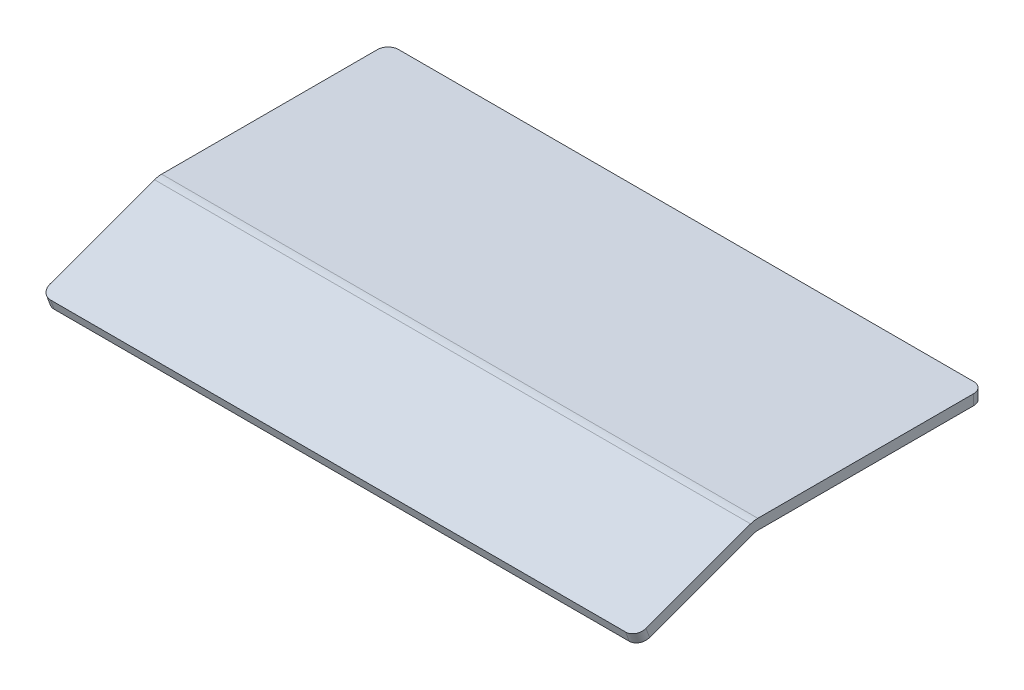
ISO-10303-21;
HEADER;
FILE_DESCRIPTION(('STEP AP214'),'2;1');
FILE_NAME('part.step','',(''),(''),'','','');
FILE_SCHEMA(('AUTOMOTIVE_DESIGN { 1 0 10303 214 1 1 1 1 }'));
ENDSEC;
DATA;
#1=APPLICATION_CONTEXT('core data for automotive mechanical design processes');
#2=APPLICATION_PROTOCOL_DEFINITION('international standard','automotive_design',2000,#1);
#3=PRODUCT_CONTEXT('',#1,'mechanical');
#4=PRODUCT('Part','Part','',(#3));
#5=PRODUCT_RELATED_PRODUCT_CATEGORY('part','',(#4));
#6=PRODUCT_DEFINITION_FORMATION('','',#4);
#7=PRODUCT_DEFINITION_CONTEXT('part definition',#1,'design');
#8=PRODUCT_DEFINITION('design','',#6,#7);
#9=PRODUCT_DEFINITION_SHAPE('','',#8);
#10=(LENGTH_UNIT() NAMED_UNIT(*) SI_UNIT(.MILLI.,.METRE.));
#11=(NAMED_UNIT(*) PLANE_ANGLE_UNIT() SI_UNIT($,.RADIAN.));
#12=(NAMED_UNIT(*) SI_UNIT($,.STERADIAN.) SOLID_ANGLE_UNIT());
#13=UNCERTAINTY_MEASURE_WITH_UNIT(LENGTH_MEASURE(1.E-05),#10,'distance_accuracy_value','');
#14=(GEOMETRIC_REPRESENTATION_CONTEXT(3) GLOBAL_UNCERTAINTY_ASSIGNED_CONTEXT((#13)) GLOBAL_UNIT_ASSIGNED_CONTEXT((#10,
#11,#12)) REPRESENTATION_CONTEXT('',''));
#15=CARTESIAN_POINT('',(0.,0.,0.));
#16=DIRECTION('',(0.,0.,1.));
#17=DIRECTION('',(1.,0.,0.));
#18=AXIS2_PLACEMENT_3D('',#15,#16,#17);
#19=CARTESIAN_POINT('',(180.975,6.35,0.));
#20=DIRECTION('',(0.,1.,0.));
#21=DIRECTION('',(0.,0.,1.));
#22=AXIS2_PLACEMENT_3D('',#19,#20,#21);
#23=PLANE('',#22);
#24=DIRECTION('',(0.,0.,-1.));
#25=VECTOR('',#24,1.);
#26=CARTESIAN_POINT('',(180.975,6.35,0.));
#27=LINE('',#26,#25);
#28=CARTESIAN_POINT('',(180.975,6.35,-1.11967632749875));
#29=VERTEX_POINT('',#28);
#30=CARTESIAN_POINT('',(180.975,6.35,-132.230323672501));
#31=VERTEX_POINT('',#30);
#32=EDGE_CURVE('E135',#29,#31,#27,.T.);
#33=ORIENTED_EDGE('',*,*,#32,.T.);
#34=CARTESIAN_POINT('',(174.625,6.35,-132.230323672501));
#35=DIRECTION('',(0.,1.,0.));
#36=DIRECTION('',(0.,0.,1.));
#37=AXIS2_PLACEMENT_3D('',#34,#35,#36);
#38=CIRCLE('',#37,6.35);
#39=CARTESIAN_POINT('',(174.625,6.35,-138.580323672501));
#40=VERTEX_POINT('',#39);
#41=EDGE_CURVE('E224',#31,#40,#38,.T.);
#42=ORIENTED_EDGE('',*,*,#41,.T.);
#43=DIRECTION('',(-1.,0.,0.));
#44=VECTOR('',#43,1.);
#45=CARTESIAN_POINT('',(180.975,6.35,-138.580323672501));
#46=LINE('',#45,#44);
#47=CARTESIAN_POINT('',(-174.625,6.35,-138.580323672501));
#48=VERTEX_POINT('',#47);
#49=EDGE_CURVE('E178',#40,#48,#46,.T.);
#50=ORIENTED_EDGE('',*,*,#49,.T.);
#51=CARTESIAN_POINT('',(-174.625,6.35,-132.230323672501));
#52=DIRECTION('',(0.,1.,0.));
#53=DIRECTION('',(0.,0.,1.));
#54=AXIS2_PLACEMENT_3D('',#51,#52,#53);
#55=CIRCLE('',#54,6.35);
#56=CARTESIAN_POINT('',(-180.975,6.35,-132.230323672501));
#57=VERTEX_POINT('',#56);
#58=EDGE_CURVE('E221',#48,#57,#55,.T.);
#59=ORIENTED_EDGE('',*,*,#58,.T.);
#60=DIRECTION('',(0.,0.,-1.));
#61=VECTOR('',#60,1.);
#62=CARTESIAN_POINT('',(-180.975,6.35,0.));
#63=LINE('',#62,#61);
#64=CARTESIAN_POINT('',(-180.975,6.35,-1.11967632749875));
#65=VERTEX_POINT('',#64);
#66=EDGE_CURVE('E137',#65,#57,#63,.T.);
#67=ORIENTED_EDGE('',*,*,#66,.F.);
#68=DIRECTION('',(-1.,0.,0.));
#69=VECTOR('',#68,1.);
#70=CARTESIAN_POINT('',(180.975,6.35,-1.11967632749875));
#71=LINE('',#70,#69);
#72=EDGE_CURVE('E132',#29,#65,#71,.T.);
#73=ORIENTED_EDGE('',*,*,#72,.F.);
#74=EDGE_LOOP('',(#33,#42,#50,#59,#67,#73));
#75=FACE_BOUND('',#74,.T.);
#76=ADVANCED_FACE('F42',(#75),#23,.T.);
#77=CARTESIAN_POINT('',(180.975,-6.35,-1.11967632749875));
#78=DIRECTION('',(-1.,0.,0.));
#79=DIRECTION('',(0.,0.,1.));
#80=AXIS2_PLACEMENT_3D('',#77,#78,#79);
#81=CYLINDRICAL_SURFACE('',#80,12.7);
#82=CARTESIAN_POINT('',(-180.975,-6.35,-1.11967632749875));
#83=DIRECTION('',(1.,0.,0.));
#84=DIRECTION('',(0.,0.,-1.));
#85=AXIS2_PLACEMENT_3D('',#82,#83,#84);
#86=CIRCLE('',#85,12.7);
#87=CARTESIAN_POINT('',(-180.975,5.58409628398103,3.22397949273726));
#88=VERTEX_POINT('',#87);
#89=EDGE_CURVE('E181',#65,#88,#86,.T.);
#90=ORIENTED_EDGE('',*,*,#89,.T.);
#91=DIRECTION('',(-1.,0.,0.));
#92=VECTOR('',#91,1.);
#93=CARTESIAN_POINT('',(180.975,5.58409628398103,3.22397949273726));
#94=LINE('',#93,#92);
#95=CARTESIAN_POINT('',(180.975,5.58409628398103,3.22397949273726));
#96=VERTEX_POINT('',#95);
#97=EDGE_CURVE('E142',#96,#88,#94,.T.);
#98=ORIENTED_EDGE('',*,*,#97,.F.);
#99=CARTESIAN_POINT('',(180.975,-6.35,-1.11967632749875));
#100=DIRECTION('',(1.,0.,0.));
#101=DIRECTION('',(0.,0.,-1.));
#102=AXIS2_PLACEMENT_3D('',#99,#100,#101);
#103=CIRCLE('',#102,12.7);
#104=EDGE_CURVE('E145',#29,#96,#103,.T.);
#105=ORIENTED_EDGE('',*,*,#104,.F.);
#106=ORIENTED_EDGE('',*,*,#72,.T.);
#107=EDGE_LOOP('',(#90,#98,#105,#106));
#108=FACE_BOUND('',#107,.T.);
#109=ADVANCED_FACE('F146',(#108),#81,.T.);
#110=CARTESIAN_POINT('',(180.975,5.96704814199051,2.171827910118));
#111=DIRECTION('',(0.,-0.939692620785908,-0.34202014332567));
#112=DIRECTION('',(0.,0.34202014332567,-0.939692620785908));
#113=AXIS2_PLACEMENT_3D('',#110,#111,#112);
#114=PLANE('',#113);
#115=DIRECTION('',(0.,-0.34202014332567,0.939692620785908));
#116=VECTOR('',#115,1.);
#117=CARTESIAN_POINT('',(-180.975,5.96704814199051,2.171827910118));
#118=LINE('',#117,#116);
#119=CARTESIAN_POINT('',(-180.975,-17.540107011298,66.7572058893944));
#120=VERTEX_POINT('',#119);
#121=EDGE_CURVE('E184',#88,#120,#118,.T.);
#122=ORIENTED_EDGE('',*,*,#121,.T.);
#123=CARTESIAN_POINT('',(-174.625,-17.5401070112981,66.7572058893944));
#124=DIRECTION('',(0.,-0.939692620785908,-0.34202014332567));
#125=DIRECTION('',(0.,0.34202014332567,-0.939692620785908));
#126=AXIS2_PLACEMENT_3D('',#123,#124,#125);
#127=CIRCLE('',#126,6.35);
#128=CARTESIAN_POINT('',(-174.625,-19.7119349214161,72.7242540313849));
#129=VERTEX_POINT('',#128);
#130=EDGE_CURVE('E11',#120,#129,#127,.F.);
#131=ORIENTED_EDGE('',*,*,#130,.T.);
#132=DIRECTION('',(-1.,0.,0.));
#133=VECTOR('',#132,1.);
#134=CARTESIAN_POINT('',(180.975,-19.7119349214161,72.7242540313849));
#135=LINE('',#134,#133);
#136=CARTESIAN_POINT('',(174.625,-19.7119349214161,72.7242540313849));
#137=VERTEX_POINT('',#136);
#138=EDGE_CURVE('E211',#137,#129,#135,.T.);
#139=ORIENTED_EDGE('',*,*,#138,.F.);
#140=CARTESIAN_POINT('',(174.625,-17.540107011298,66.7572058893944));
#141=DIRECTION('',(0.,-0.939692620785908,-0.34202014332567));
#142=DIRECTION('',(0.,0.34202014332567,-0.939692620785908));
#143=AXIS2_PLACEMENT_3D('',#140,#141,#142);
#144=CIRCLE('',#143,6.35);
#145=CARTESIAN_POINT('',(180.975,-17.540107011298,66.7572058893944));
#146=VERTEX_POINT('',#145);
#147=EDGE_CURVE('E51',#137,#146,#144,.F.);
#148=ORIENTED_EDGE('',*,*,#147,.T.);
#149=DIRECTION('',(0.,-0.34202014332567,0.939692620785908));
#150=VECTOR('',#149,1.);
#151=CARTESIAN_POINT('',(180.975,5.96704814199051,2.171827910118));
#152=LINE('',#151,#150);
#153=EDGE_CURVE('E152',#96,#146,#152,.T.);
#154=ORIENTED_EDGE('',*,*,#153,.F.);
#155=ORIENTED_EDGE('',*,*,#97,.T.);
#156=EDGE_LOOP('',(#122,#131,#139,#148,#154,#155));
#157=FACE_BOUND('',#156,.T.);
#158=ADVANCED_FACE('F259',(#157),#114,.F.);
#159=CARTESIAN_POINT('',(180.975,-25.6789830634065,70.5524261212669));
#160=DIRECTION('',(0.,0.342020143325669,-0.939692620785908));
#161=DIRECTION('',(0.,0.939692620785908,0.342020143325669));
#162=AXIS2_PLACEMENT_3D('',#159,#160,#161);
#163=PLANE('',#162);
#164=ORIENTED_EDGE('',*,*,#138,.T.);
#165=DIRECTION('',(0.,-0.939692620785908,-0.342020143325669));
#166=VECTOR('',#165,1.);
#167=CARTESIAN_POINT('',(-174.625,-25.6789830634065,70.5524261212669));
#168=LINE('',#167,#166);
#169=CARTESIAN_POINT('',(-174.625,-25.6789830634066,70.5524261212669));
#170=VERTEX_POINT('',#169);
#171=EDGE_CURVE('E248',#129,#170,#168,.T.);
#172=ORIENTED_EDGE('',*,*,#171,.T.);
#173=DIRECTION('',(-1.,0.,0.));
#174=VECTOR('',#173,1.);
#175=CARTESIAN_POINT('',(180.975,-25.6789830634066,70.5524261212669));
#176=LINE('',#175,#174);
#177=CARTESIAN_POINT('',(174.625,-25.6789830634066,70.5524261212669));
#178=VERTEX_POINT('',#177);
#179=EDGE_CURVE('E207',#178,#170,#176,.T.);
#180=ORIENTED_EDGE('',*,*,#179,.F.);
#181=DIRECTION('',(0.,-0.939692620785908,-0.342020143325669));
#182=VECTOR('',#181,1.);
#183=CARTESIAN_POINT('',(174.625,-19.7119349214161,72.7242540313849));
#184=LINE('',#183,#182);
#185=EDGE_CURVE('E63',#178,#137,#184,.F.);
#186=ORIENTED_EDGE('',*,*,#185,.T.);
#187=EDGE_LOOP('',(#164,#172,#180,#186));
#188=FACE_BOUND('',#187,.T.);
#189=ADVANCED_FACE('F266',(#188),#163,.F.);
#190=CARTESIAN_POINT('',(180.975,0.,0.));
#191=DIRECTION('',(0.,0.939692620785908,0.34202014332567));
#192=DIRECTION('',(0.,-0.34202014332567,0.939692620785908));
#193=AXIS2_PLACEMENT_3D('',#190,#191,#192);
#194=PLANE('',#193);
#195=ORIENTED_EDGE('',*,*,#179,.T.);
#196=CARTESIAN_POINT('',(-174.625,-23.5071551532886,64.5853779792764));
#197=DIRECTION('',(0.,0.939692620785908,0.34202014332567));
#198=DIRECTION('',(0.,-0.34202014332567,0.939692620785908));
#199=AXIS2_PLACEMENT_3D('',#196,#197,#198);
#200=CIRCLE('',#199,6.35);
#201=CARTESIAN_POINT('',(-180.975,-23.5071551532886,64.5853779792764));
#202=VERTEX_POINT('',#201);
#203=EDGE_CURVE('E255',#170,#202,#200,.F.);
#204=ORIENTED_EDGE('',*,*,#203,.T.);
#205=DIRECTION('',(0.,0.34202014332567,-0.939692620785908));
#206=VECTOR('',#205,1.);
#207=CARTESIAN_POINT('',(-180.975,0.,0.));
#208=LINE('',#207,#206);
#209=CARTESIAN_POINT('',(-180.975,-0.382951858009493,1.05215158261927));
#210=VERTEX_POINT('',#209);
#211=EDGE_CURVE('E187',#202,#210,#208,.T.);
#212=ORIENTED_EDGE('',*,*,#211,.T.);
#213=DIRECTION('',(-1.,0.,0.));
#214=VECTOR('',#213,1.);
#215=CARTESIAN_POINT('',(180.975,-0.382951858009493,1.05215158261927));
#216=LINE('',#215,#214);
#217=CARTESIAN_POINT('',(180.975,-0.382951858009493,1.05215158261927));
#218=VERTEX_POINT('',#217);
#219=EDGE_CURVE('E203',#218,#210,#216,.T.);
#220=ORIENTED_EDGE('',*,*,#219,.F.);
#221=DIRECTION('',(0.,0.34202014332567,-0.939692620785908));
#222=VECTOR('',#221,1.);
#223=CARTESIAN_POINT('',(180.975,0.,0.));
#224=LINE('',#223,#222);
#225=CARTESIAN_POINT('',(180.975,-23.5071551532886,64.5853779792764));
#226=VERTEX_POINT('',#225);
#227=EDGE_CURVE('E169',#226,#218,#224,.T.);
#228=ORIENTED_EDGE('',*,*,#227,.F.);
#229=CARTESIAN_POINT('',(174.625,-23.5071551532886,64.5853779792764));
#230=DIRECTION('',(0.,0.939692620785908,0.34202014332567));
#231=DIRECTION('',(0.,-0.34202014332567,0.939692620785908));
#232=AXIS2_PLACEMENT_3D('',#229,#230,#231);
#233=CIRCLE('',#232,6.35);
#234=EDGE_CURVE('E252',#226,#178,#233,.F.);
#235=ORIENTED_EDGE('',*,*,#234,.T.);
#236=EDGE_LOOP('',(#195,#204,#212,#220,#228,#235));
#237=FACE_BOUND('',#236,.T.);
#238=ADVANCED_FACE('F264',(#237),#194,.F.);
#239=CARTESIAN_POINT('',(180.975,-6.35,-1.11967632749875));
#240=DIRECTION('',(-1.,0.,0.));
#241=DIRECTION('',(0.,0.,1.));
#242=AXIS2_PLACEMENT_3D('',#239,#240,#241);
#243=CYLINDRICAL_SURFACE('',#242,6.35);
#244=CARTESIAN_POINT('',(-180.975,-6.35,-1.11967632749875));
#245=DIRECTION('',(1.,0.,0.));
#246=DIRECTION('',(0.,0.,-1.));
#247=AXIS2_PLACEMENT_3D('',#244,#245,#246);
#248=CIRCLE('',#247,6.35);
#249=CARTESIAN_POINT('',(-180.975,0.,-1.11967632749878));
#250=VERTEX_POINT('',#249);
#251=EDGE_CURVE('E164',#210,#250,#248,.F.);
#252=ORIENTED_EDGE('',*,*,#251,.T.);
#253=DIRECTION('',(-1.,0.,0.));
#254=VECTOR('',#253,1.);
#255=CARTESIAN_POINT('',(180.975,0.,-1.11967632749878));
#256=LINE('',#255,#254);
#257=CARTESIAN_POINT('',(180.975,0.,-1.11967632749878));
#258=VERTEX_POINT('',#257);
#259=EDGE_CURVE('E199',#258,#250,#256,.T.);
#260=ORIENTED_EDGE('',*,*,#259,.F.);
#261=CARTESIAN_POINT('',(180.975,-6.35,-1.11967632749875));
#262=DIRECTION('',(1.,0.,0.));
#263=DIRECTION('',(0.,0.,-1.));
#264=AXIS2_PLACEMENT_3D('',#261,#262,#263);
#265=CIRCLE('',#264,6.35);
#266=EDGE_CURVE('E172',#218,#258,#265,.F.);
#267=ORIENTED_EDGE('',*,*,#266,.F.);
#268=ORIENTED_EDGE('',*,*,#219,.T.);
#269=EDGE_LOOP('',(#252,#260,#267,#268));
#270=FACE_BOUND('',#269,.T.);
#271=ADVANCED_FACE('F279',(#270),#243,.F.);
#272=CARTESIAN_POINT('',(180.975,0.,0.));
#273=DIRECTION('',(0.,1.,0.));
#274=DIRECTION('',(0.,0.,1.));
#275=AXIS2_PLACEMENT_3D('',#272,#273,#274);
#276=PLANE('',#275);
#277=DIRECTION('',(-1.,0.,0.));
#278=VECTOR('',#277,1.);
#279=CARTESIAN_POINT('',(180.975,0.,-138.580323672501));
#280=LINE('',#279,#278);
#281=CARTESIAN_POINT('',(174.625,0.,-138.580323672501));
#282=VERTEX_POINT('',#281);
#283=CARTESIAN_POINT('',(-174.625,0.,-138.580323672501));
#284=VERTEX_POINT('',#283);
#285=EDGE_CURVE('E195',#282,#284,#280,.T.);
#286=ORIENTED_EDGE('',*,*,#285,.F.);
#287=CARTESIAN_POINT('',(174.625,0.,-132.230323672501));
#288=DIRECTION('',(0.,1.,0.));
#289=DIRECTION('',(0.,0.,1.));
#290=AXIS2_PLACEMENT_3D('',#287,#288,#289);
#291=CIRCLE('',#290,6.35);
#292=CARTESIAN_POINT('',(180.975,0.,-132.230323672501));
#293=VERTEX_POINT('',#292);
#294=EDGE_CURVE('E237',#282,#293,#291,.F.);
#295=ORIENTED_EDGE('',*,*,#294,.T.);
#296=DIRECTION('',(0.,0.,-1.));
#297=VECTOR('',#296,1.);
#298=CARTESIAN_POINT('',(180.975,0.,0.));
#299=LINE('',#298,#297);
#300=EDGE_CURVE('E175',#258,#293,#299,.T.);
#301=ORIENTED_EDGE('',*,*,#300,.F.);
#302=ORIENTED_EDGE('',*,*,#259,.T.);
#303=DIRECTION('',(0.,0.,-1.));
#304=VECTOR('',#303,1.);
#305=CARTESIAN_POINT('',(-180.975,0.,0.));
#306=LINE('',#305,#304);
#307=CARTESIAN_POINT('',(-180.975,0.,-132.230323672501));
#308=VERTEX_POINT('',#307);
#309=EDGE_CURVE('E160',#250,#308,#306,.T.);
#310=ORIENTED_EDGE('',*,*,#309,.T.);
#311=CARTESIAN_POINT('',(-174.625,0.,-132.230323672501));
#312=DIRECTION('',(0.,1.,0.));
#313=DIRECTION('',(0.,0.,1.));
#314=AXIS2_PLACEMENT_3D('',#311,#312,#313);
#315=CIRCLE('',#314,6.35);
#316=EDGE_CURVE('E234',#308,#284,#315,.F.);
#317=ORIENTED_EDGE('',*,*,#316,.T.);
#318=EDGE_LOOP('',(#286,#295,#301,#302,#310,#317));
#319=FACE_BOUND('',#318,.T.);
#320=ADVANCED_FACE('F284',(#319),#276,.F.);
#321=CARTESIAN_POINT('',(180.975,0.,-138.580323672501));
#322=DIRECTION('',(0.,0.,1.));
#323=DIRECTION('',(1.,0.,0.));
#324=AXIS2_PLACEMENT_3D('',#321,#322,#323);
#325=PLANE('',#324);
#326=ORIENTED_EDGE('',*,*,#49,.F.);
#327=DIRECTION('',(0.,1.,0.));
#328=VECTOR('',#327,1.);
#329=CARTESIAN_POINT('',(174.625,0.,-138.580323672501));
#330=LINE('',#329,#328);
#331=EDGE_CURVE('E231',#40,#282,#330,.F.);
#332=ORIENTED_EDGE('',*,*,#331,.T.);
#333=ORIENTED_EDGE('',*,*,#285,.T.);
#334=DIRECTION('',(0.,1.,0.));
#335=VECTOR('',#334,1.);
#336=CARTESIAN_POINT('',(-174.625,0.,-138.580323672501));
#337=LINE('',#336,#335);
#338=EDGE_CURVE('E227',#284,#48,#337,.T.);
#339=ORIENTED_EDGE('',*,*,#338,.T.);
#340=EDGE_LOOP('',(#326,#332,#333,#339));
#341=FACE_BOUND('',#340,.T.);
#342=ADVANCED_FACE('F292',(#341),#325,.F.);
#343=CARTESIAN_POINT('',(180.975,0.,0.));
#344=DIRECTION('',(1.,0.,0.));
#345=DIRECTION('',(0.,0.,-1.));
#346=AXIS2_PLACEMENT_3D('',#343,#344,#345);
#347=PLANE('',#346);
#348=ORIENTED_EDGE('',*,*,#300,.T.);
#349=DIRECTION('',(0.,1.,0.));
#350=VECTOR('',#349,1.);
#351=CARTESIAN_POINT('',(180.975,6.35,-132.230323672501));
#352=LINE('',#351,#350);
#353=EDGE_CURVE('E158',#293,#31,#352,.T.);
#354=ORIENTED_EDGE('',*,*,#353,.T.);
#355=ORIENTED_EDGE('',*,*,#32,.F.);
#356=ORIENTED_EDGE('',*,*,#104,.T.);
#357=ORIENTED_EDGE('',*,*,#153,.T.);
#358=DIRECTION('',(0.,-0.939692620785908,-0.342020143325669));
#359=VECTOR('',#358,1.);
#360=CARTESIAN_POINT('',(180.975,-23.5071551532886,64.5853779792764));
#361=LINE('',#360,#359);
#362=EDGE_CURVE('E141',#146,#226,#361,.T.);
#363=ORIENTED_EDGE('',*,*,#362,.T.);
#364=ORIENTED_EDGE('',*,*,#227,.T.);
#365=ORIENTED_EDGE('',*,*,#266,.T.);
#366=EDGE_LOOP('',(#348,#354,#355,#356,#357,#363,#364,#365));
#367=FACE_BOUND('',#366,.T.);
#368=ADVANCED_FACE('F156',(#367),#347,.T.);
#369=CARTESIAN_POINT('',(-180.975,0.,0.));
#370=DIRECTION('',(1.,0.,0.));
#371=DIRECTION('',(0.,0.,-1.));
#372=AXIS2_PLACEMENT_3D('',#369,#370,#371);
#373=PLANE('',#372);
#374=ORIENTED_EDGE('',*,*,#66,.T.);
#375=DIRECTION('',(0.,1.,0.));
#376=VECTOR('',#375,1.);
#377=CARTESIAN_POINT('',(-180.975,0.,-132.230323672501));
#378=LINE('',#377,#376);
#379=EDGE_CURVE('E243',#57,#308,#378,.F.);
#380=ORIENTED_EDGE('',*,*,#379,.T.);
#381=ORIENTED_EDGE('',*,*,#309,.F.);
#382=ORIENTED_EDGE('',*,*,#251,.F.);
#383=ORIENTED_EDGE('',*,*,#211,.F.);
#384=DIRECTION('',(0.,-0.939692620785908,-0.342020143325669));
#385=VECTOR('',#384,1.);
#386=CARTESIAN_POINT('',(-180.975,-23.5071551532885,64.5853779792764));
#387=LINE('',#386,#385);
#388=EDGE_CURVE('E240',#202,#120,#387,.F.);
#389=ORIENTED_EDGE('',*,*,#388,.T.);
#390=ORIENTED_EDGE('',*,*,#121,.F.);
#391=ORIENTED_EDGE('',*,*,#89,.F.);
#392=EDGE_LOOP('',(#374,#380,#381,#382,#383,#389,#390,#391));
#393=FACE_BOUND('',#392,.T.);
#394=ADVANCED_FACE('F274',(#393),#373,.F.);
#395=CARTESIAN_POINT('',(174.625,0.,-132.230323672501));
#396=DIRECTION('',(0.,-1.,0.));
#397=DIRECTION('',(0.,0.,-1.));
#398=AXIS2_PLACEMENT_3D('',#395,#396,#397);
#399=CYLINDRICAL_SURFACE('',#398,6.35);
#400=ORIENTED_EDGE('',*,*,#294,.F.);
#401=ORIENTED_EDGE('',*,*,#331,.F.);
#402=ORIENTED_EDGE('',*,*,#41,.F.);
#403=ORIENTED_EDGE('',*,*,#353,.F.);
#404=EDGE_LOOP('',(#400,#401,#402,#403));
#405=FACE_BOUND('',#404,.T.);
#406=ADVANCED_FACE('F288',(#405),#399,.T.);
#407=CARTESIAN_POINT('',(-174.625,0.,-132.230323672501));
#408=DIRECTION('',(0.,1.,0.));
#409=DIRECTION('',(0.,0.,1.));
#410=AXIS2_PLACEMENT_3D('',#407,#408,#409);
#411=CYLINDRICAL_SURFACE('',#410,6.35);
#412=ORIENTED_EDGE('',*,*,#316,.F.);
#413=ORIENTED_EDGE('',*,*,#379,.F.);
#414=ORIENTED_EDGE('',*,*,#58,.F.);
#415=ORIENTED_EDGE('',*,*,#338,.F.);
#416=EDGE_LOOP('',(#412,#413,#414,#415));
#417=FACE_BOUND('',#416,.T.);
#418=ADVANCED_FACE('F295',(#417),#411,.T.);
#419=CARTESIAN_POINT('',(-174.625,-23.5071551532885,64.5853779792764));
#420=DIRECTION('',(0.,-0.939692620785908,-0.342020143325669));
#421=DIRECTION('',(0.,0.342020143325669,-0.939692620785908));
#422=AXIS2_PLACEMENT_3D('',#419,#420,#421);
#423=CYLINDRICAL_SURFACE('',#422,6.35);
#424=ORIENTED_EDGE('',*,*,#130,.F.);
#425=ORIENTED_EDGE('',*,*,#388,.F.);
#426=ORIENTED_EDGE('',*,*,#203,.F.);
#427=ORIENTED_EDGE('',*,*,#171,.F.);
#428=EDGE_LOOP('',(#424,#425,#426,#427));
#429=FACE_BOUND('',#428,.T.);
#430=ADVANCED_FACE('F269',(#429),#423,.T.);
#431=CARTESIAN_POINT('',(174.625,-23.5071551532885,64.5853779792764));
#432=DIRECTION('',(0.,0.939692620785908,0.342020143325669));
#433=DIRECTION('',(0.,-0.342020143325669,0.939692620785908));
#434=AXIS2_PLACEMENT_3D('',#431,#432,#433);
#435=CYLINDRICAL_SURFACE('',#434,6.35);
#436=ORIENTED_EDGE('',*,*,#147,.F.);
#437=ORIENTED_EDGE('',*,*,#185,.F.);
#438=ORIENTED_EDGE('',*,*,#234,.F.);
#439=ORIENTED_EDGE('',*,*,#362,.F.);
#440=EDGE_LOOP('',(#436,#437,#438,#439));
#441=FACE_BOUND('',#440,.T.);
#442=ADVANCED_FACE('F44',(#441),#435,.T.);
#443=CLOSED_SHELL('',(#76,#109,#158,#189,#238,#271,#320,#342,#368,#394,#406,#418,#430,#442));
#444=MANIFOLD_SOLID_BREP('B2',#443);
#445=ADVANCED_BREP_SHAPE_REPRESENTATION('',(#18,#444),#14);
#446=SHAPE_DEFINITION_REPRESENTATION(#9,#445);
ENDSEC;
END-ISO-10303-21;
